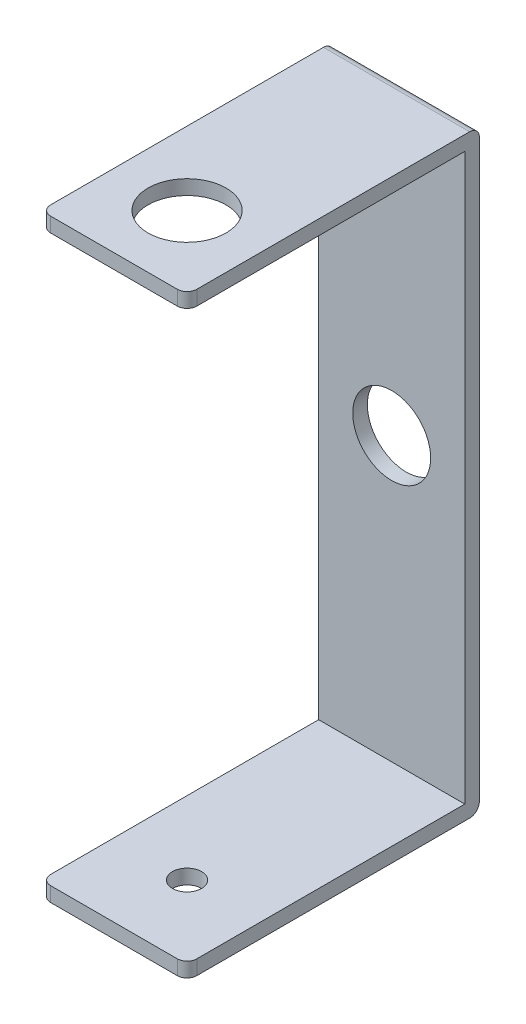
ISO-10303-21;
HEADER;
FILE_DESCRIPTION(('STEP AP214'),'2;1');
FILE_NAME('part.step','',(''),(''),'','','');
FILE_SCHEMA(('AUTOMOTIVE_DESIGN { 1 0 10303 214 1 1 1 1 }'));
ENDSEC;
DATA;
#1=APPLICATION_CONTEXT('core data for automotive mechanical design processes');
#2=APPLICATION_PROTOCOL_DEFINITION('international standard','automotive_design',2000,#1);
#3=PRODUCT_CONTEXT('',#1,'mechanical');
#4=PRODUCT('Part','Part','',(#3));
#5=PRODUCT_RELATED_PRODUCT_CATEGORY('part','',(#4));
#6=PRODUCT_DEFINITION_FORMATION('','',#4);
#7=PRODUCT_DEFINITION_CONTEXT('part definition',#1,'design');
#8=PRODUCT_DEFINITION('design','',#6,#7);
#9=PRODUCT_DEFINITION_SHAPE('','',#8);
#10=(LENGTH_UNIT() NAMED_UNIT(*) SI_UNIT(.MILLI.,.METRE.));
#11=(NAMED_UNIT(*) PLANE_ANGLE_UNIT() SI_UNIT($,.RADIAN.));
#12=(NAMED_UNIT(*) SI_UNIT($,.STERADIAN.) SOLID_ANGLE_UNIT());
#13=UNCERTAINTY_MEASURE_WITH_UNIT(LENGTH_MEASURE(1.E-05),#10,'distance_accuracy_value','');
#14=(GEOMETRIC_REPRESENTATION_CONTEXT(3) GLOBAL_UNCERTAINTY_ASSIGNED_CONTEXT((#13)) GLOBAL_UNIT_ASSIGNED_CONTEXT((#10,
#11,#12)) REPRESENTATION_CONTEXT('',''));
#15=CARTESIAN_POINT('',(0.,0.,0.));
#16=DIRECTION('',(0.,0.,1.));
#17=DIRECTION('',(1.,0.,0.));
#18=AXIS2_PLACEMENT_3D('',#15,#16,#17);
#19=CARTESIAN_POINT('',(0.,0.,1.5));
#20=DIRECTION('',(0.,0.,1.));
#21=DIRECTION('',(1.,0.,0.));
#22=AXIS2_PLACEMENT_3D('',#19,#20,#21);
#23=PLANE('',#22);
#24=CARTESIAN_POINT('',(0.,0.,1.5));
#25=DIRECTION('',(0.,0.,1.));
#26=DIRECTION('',(1.,0.,0.));
#27=AXIS2_PLACEMENT_3D('',#24,#25,#26);
#28=CIRCLE('',#27,4.);
#29=CARTESIAN_POINT('',(4.,0.,1.5));
#30=VERTEX_POINT('',#29);
#31=EDGE_CURVE('E159',#30,#30,#28,.T.);
#32=ORIENTED_EDGE('',*,*,#31,.F.);
#33=EDGE_LOOP('',(#32));
#34=FACE_BOUND('',#33,.T.);
#35=DIRECTION('',(0.,1.,0.));
#36=VECTOR('',#35,1.);
#37=CARTESIAN_POINT('',(-7.5,0.,1.5));
#38=LINE('',#37,#36);
#39=CARTESIAN_POINT('',(-7.49999999999999,-29.,1.5));
#40=VERTEX_POINT('',#39);
#41=CARTESIAN_POINT('',(-7.5,29.,1.5));
#42=VERTEX_POINT('',#41);
#43=EDGE_CURVE('E158',#40,#42,#38,.T.);
#44=ORIENTED_EDGE('',*,*,#43,.F.);
#45=DIRECTION('',(-1.,0.,0.));
#46=VECTOR('',#45,1.);
#47=CARTESIAN_POINT('',(7.5,-29.,1.5));
#48=LINE('',#47,#46);
#49=CARTESIAN_POINT('',(7.5,-29.,1.5));
#50=VERTEX_POINT('',#49);
#51=EDGE_CURVE('E157',#50,#40,#48,.T.);
#52=ORIENTED_EDGE('',*,*,#51,.F.);
#53=DIRECTION('',(0.,1.,0.));
#54=VECTOR('',#53,1.);
#55=CARTESIAN_POINT('',(7.5,0.,1.5));
#56=LINE('',#55,#54);
#57=CARTESIAN_POINT('',(7.5,29.,1.5));
#58=VERTEX_POINT('',#57);
#59=EDGE_CURVE('E142',#50,#58,#56,.T.);
#60=ORIENTED_EDGE('',*,*,#59,.T.);
#61=DIRECTION('',(1.,0.,0.));
#62=VECTOR('',#61,1.);
#63=CARTESIAN_POINT('',(-7.49999999999999,29.,1.5));
#64=LINE('',#63,#62);
#65=EDGE_CURVE('E155',#42,#58,#64,.T.);
#66=ORIENTED_EDGE('',*,*,#65,.F.);
#67=EDGE_LOOP('',(#44,#52,#60,#66));
#68=FACE_BOUND('',#67,.T.);
#69=ADVANCED_FACE('F34',(#34,#68),#23,.T.);
#70=CARTESIAN_POINT('',(0.,-30.5,1.5));
#71=DIRECTION('',(0.,1.,0.));
#72=DIRECTION('',(-1.,0.,0.));
#73=AXIS2_PLACEMENT_3D('',#70,#71,#72);
#74=PLANE('',#73);
#75=CARTESIAN_POINT('',(0.,-30.5,22.5));
#76=DIRECTION('',(0.,1.,0.));
#77=DIRECTION('',(0.,0.,1.));
#78=AXIS2_PLACEMENT_3D('',#75,#76,#77);
#79=CIRCLE('',#78,1.5);
#80=CARTESIAN_POINT('',(0.,-30.5,24.));
#81=VERTEX_POINT('',#80);
#82=EDGE_CURVE('E193',#81,#81,#79,.T.);
#83=ORIENTED_EDGE('',*,*,#82,.T.);
#84=EDGE_LOOP('',(#83));
#85=FACE_BOUND('',#84,.T.);
#86=DIRECTION('',(0.,0.,-1.));
#87=VECTOR('',#86,1.);
#88=CARTESIAN_POINT('',(-7.49999999999999,-30.5,1.5));
#89=LINE('',#88,#87);
#90=CARTESIAN_POINT('',(-7.49999999999999,-30.5,29.));
#91=VERTEX_POINT('',#90);
#92=CARTESIAN_POINT('',(-7.49999999999999,-30.5,1.));
#93=VERTEX_POINT('',#92);
#94=EDGE_CURVE('E329',#91,#93,#89,.T.);
#95=ORIENTED_EDGE('',*,*,#94,.T.);
#96=DIRECTION('',(1.,0.,0.));
#97=VECTOR('',#96,1.);
#98=CARTESIAN_POINT('',(0.,-30.5,1.));
#99=LINE('',#98,#97);
#100=CARTESIAN_POINT('',(7.5,-30.5,1.));
#101=VERTEX_POINT('',#100);
#102=EDGE_CURVE('E198',#93,#101,#99,.T.);
#103=ORIENTED_EDGE('',*,*,#102,.T.);
#104=DIRECTION('',(0.,0.,-1.));
#105=VECTOR('',#104,1.);
#106=CARTESIAN_POINT('',(7.5,-30.5,1.5));
#107=LINE('',#106,#105);
#108=CARTESIAN_POINT('',(7.5,-30.5,29.));
#109=VERTEX_POINT('',#108);
#110=EDGE_CURVE('E174',#109,#101,#107,.T.);
#111=ORIENTED_EDGE('',*,*,#110,.F.);
#112=CARTESIAN_POINT('',(6.5,-30.5,29.));
#113=DIRECTION('',(0.,1.,0.));
#114=DIRECTION('',(-1.,0.,0.));
#115=AXIS2_PLACEMENT_3D('',#112,#113,#114);
#116=CIRCLE('',#115,1.);
#117=CARTESIAN_POINT('',(6.5,-30.5,30.));
#118=VERTEX_POINT('',#117);
#119=EDGE_CURVE('E194',#109,#118,#116,.F.);
#120=ORIENTED_EDGE('',*,*,#119,.T.);
#121=DIRECTION('',(1.,0.,0.));
#122=VECTOR('',#121,1.);
#123=CARTESIAN_POINT('',(7.5,-30.5,30.));
#124=LINE('',#123,#122);
#125=CARTESIAN_POINT('',(-6.49999999999999,-30.5,30.));
#126=VERTEX_POINT('',#125);
#127=EDGE_CURVE('E321',#126,#118,#124,.T.);
#128=ORIENTED_EDGE('',*,*,#127,.F.);
#129=CARTESIAN_POINT('',(-6.49999999999999,-30.5,29.));
#130=DIRECTION('',(0.,1.,0.));
#131=DIRECTION('',(-1.,0.,0.));
#132=AXIS2_PLACEMENT_3D('',#129,#130,#131);
#133=CIRCLE('',#132,1.);
#134=EDGE_CURVE('E196',#126,#91,#133,.F.);
#135=ORIENTED_EDGE('',*,*,#134,.T.);
#136=EDGE_LOOP('',(#95,#103,#111,#120,#128,#135));
#137=FACE_BOUND('',#136,.T.);
#138=ADVANCED_FACE('F271',(#85,#137),#74,.F.);
#139=CARTESIAN_POINT('',(7.5,0.,1.5));
#140=DIRECTION('',(-1.,0.,0.));
#141=DIRECTION('',(0.,0.,1.));
#142=AXIS2_PLACEMENT_3D('',#139,#140,#141);
#143=PLANE('',#142);
#144=ORIENTED_EDGE('',*,*,#110,.T.);
#145=CARTESIAN_POINT('',(7.5,-29.5,1.));
#146=DIRECTION('',(-1.,0.,0.));
#147=DIRECTION('',(0.,0.,1.));
#148=AXIS2_PLACEMENT_3D('',#145,#146,#147);
#149=CIRCLE('',#148,1.);
#150=CARTESIAN_POINT('',(7.5,-29.5,0.));
#151=VERTEX_POINT('',#150);
#152=EDGE_CURVE('E206',#101,#151,#149,.F.);
#153=ORIENTED_EDGE('',*,*,#152,.T.);
#154=DIRECTION('',(0.,1.,0.));
#155=VECTOR('',#154,1.);
#156=CARTESIAN_POINT('',(7.5,0.,0.));
#157=LINE('',#156,#155);
#158=CARTESIAN_POINT('',(7.5,29.5,0.));
#159=VERTEX_POINT('',#158);
#160=EDGE_CURVE('E337',#151,#159,#157,.T.);
#161=ORIENTED_EDGE('',*,*,#160,.T.);
#162=CARTESIAN_POINT('',(7.5,29.5,1.));
#163=DIRECTION('',(-1.,0.,0.));
#164=DIRECTION('',(0.,0.,1.));
#165=AXIS2_PLACEMENT_3D('',#162,#163,#164);
#166=CIRCLE('',#165,1.);
#167=CARTESIAN_POINT('',(7.5,30.5,1.));
#168=VERTEX_POINT('',#167);
#169=EDGE_CURVE('E200',#159,#168,#166,.F.);
#170=ORIENTED_EDGE('',*,*,#169,.T.);
#171=DIRECTION('',(0.,0.,-1.));
#172=VECTOR('',#171,1.);
#173=CARTESIAN_POINT('',(7.5,30.5,1.5));
#174=LINE('',#173,#172);
#175=CARTESIAN_POINT('',(7.5,30.5,29.));
#176=VERTEX_POINT('',#175);
#177=EDGE_CURVE('E255',#176,#168,#174,.T.);
#178=ORIENTED_EDGE('',*,*,#177,.F.);
#179=DIRECTION('',(0.,1.,0.));
#180=VECTOR('',#179,1.);
#181=CARTESIAN_POINT('',(7.5,29.,29.));
#182=LINE('',#181,#180);
#183=CARTESIAN_POINT('',(7.5,29.,29.));
#184=VERTEX_POINT('',#183);
#185=EDGE_CURVE('E144',#176,#184,#182,.F.);
#186=ORIENTED_EDGE('',*,*,#185,.T.);
#187=DIRECTION('',(0.,0.,-1.));
#188=VECTOR('',#187,1.);
#189=CARTESIAN_POINT('',(7.5,29.,30.));
#190=LINE('',#189,#188);
#191=EDGE_CURVE('E137',#184,#58,#190,.T.);
#192=ORIENTED_EDGE('',*,*,#191,.T.);
#193=ORIENTED_EDGE('',*,*,#59,.F.);
#194=DIRECTION('',(0.,0.,-1.));
#195=VECTOR('',#194,1.);
#196=CARTESIAN_POINT('',(7.5,-29.,30.));
#197=LINE('',#196,#195);
#198=CARTESIAN_POINT('',(7.5,-29.,29.));
#199=VERTEX_POINT('',#198);
#200=EDGE_CURVE('E165',#199,#50,#197,.T.);
#201=ORIENTED_EDGE('',*,*,#200,.F.);
#202=DIRECTION('',(0.,1.,0.));
#203=VECTOR('',#202,1.);
#204=CARTESIAN_POINT('',(7.5,-30.5,29.));
#205=LINE('',#204,#203);
#206=EDGE_CURVE('E204',#199,#109,#205,.F.);
#207=ORIENTED_EDGE('',*,*,#206,.T.);
#208=EDGE_LOOP('',(#144,#153,#161,#170,#178,#186,#192,#193,#201,#207));
#209=FACE_BOUND('',#208,.T.);
#210=ADVANCED_FACE('F140',(#209),#143,.F.);
#211=CARTESIAN_POINT('',(0.,30.5,1.5));
#212=DIRECTION('',(0.,1.,0.));
#213=DIRECTION('',(0.,0.,1.));
#214=AXIS2_PLACEMENT_3D('',#211,#212,#213);
#215=PLANE('',#214);
#216=CARTESIAN_POINT('',(0.,30.5,22.5));
#217=DIRECTION('',(0.,1.,0.));
#218=DIRECTION('',(0.,0.,1.));
#219=AXIS2_PLACEMENT_3D('',#216,#217,#218);
#220=CIRCLE('',#219,4.);
#221=CARTESIAN_POINT('',(0.,30.5,26.5));
#222=VERTEX_POINT('',#221);
#223=EDGE_CURVE('E381',#222,#222,#220,.T.);
#224=ORIENTED_EDGE('',*,*,#223,.F.);
#225=EDGE_LOOP('',(#224));
#226=FACE_BOUND('',#225,.T.);
#227=DIRECTION('',(-1.,0.,0.));
#228=VECTOR('',#227,1.);
#229=CARTESIAN_POINT('',(-7.5,30.5,30.));
#230=LINE('',#229,#228);
#231=CARTESIAN_POINT('',(6.49999999999999,30.5,30.));
#232=VERTEX_POINT('',#231);
#233=CARTESIAN_POINT('',(-6.5,30.5,30.));
#234=VERTEX_POINT('',#233);
#235=EDGE_CURVE('E149',#232,#234,#230,.T.);
#236=ORIENTED_EDGE('',*,*,#235,.F.);
#237=CARTESIAN_POINT('',(6.5,30.5,29.));
#238=DIRECTION('',(0.,1.,0.));
#239=DIRECTION('',(0.,0.,1.));
#240=AXIS2_PLACEMENT_3D('',#237,#238,#239);
#241=CIRCLE('',#240,1.);
#242=EDGE_CURVE('E57',#232,#176,#241,.T.);
#243=ORIENTED_EDGE('',*,*,#242,.T.);
#244=ORIENTED_EDGE('',*,*,#177,.T.);
#245=DIRECTION('',(1.,0.,0.));
#246=VECTOR('',#245,1.);
#247=CARTESIAN_POINT('',(-7.5,30.5,1.));
#248=LINE('',#247,#246);
#249=CARTESIAN_POINT('',(-7.5,30.5,1.));
#250=VERTEX_POINT('',#249);
#251=EDGE_CURVE('E239',#168,#250,#248,.F.);
#252=ORIENTED_EDGE('',*,*,#251,.T.);
#253=DIRECTION('',(0.,0.,-1.));
#254=VECTOR('',#253,1.);
#255=CARTESIAN_POINT('',(-7.5,30.5,1.5));
#256=LINE('',#255,#254);
#257=CARTESIAN_POINT('',(-7.5,30.5,29.));
#258=VERTEX_POINT('',#257);
#259=EDGE_CURVE('E258',#258,#250,#256,.T.);
#260=ORIENTED_EDGE('',*,*,#259,.F.);
#261=CARTESIAN_POINT('',(-6.5,30.5,29.));
#262=DIRECTION('',(0.,1.,0.));
#263=DIRECTION('',(0.,0.,1.));
#264=AXIS2_PLACEMENT_3D('',#261,#262,#263);
#265=CIRCLE('',#264,1.);
#266=EDGE_CURVE('E49',#258,#234,#265,.T.);
#267=ORIENTED_EDGE('',*,*,#266,.T.);
#268=EDGE_LOOP('',(#236,#243,#244,#252,#260,#267));
#269=FACE_BOUND('',#268,.T.);
#270=ADVANCED_FACE('F253',(#226,#269),#215,.T.);
#271=CARTESIAN_POINT('',(0.,0.,1.5));
#272=DIRECTION('',(0.,0.,-1.));
#273=DIRECTION('',(-1.,0.,0.));
#274=AXIS2_PLACEMENT_3D('',#271,#272,#273);
#275=CYLINDRICAL_SURFACE('',#274,4.);
#276=ORIENTED_EDGE('',*,*,#31,.T.);
#277=EDGE_LOOP('',(#276));
#278=FACE_BOUND('',#277,.T.);
#279=CARTESIAN_POINT('',(0.,0.,0.));
#280=DIRECTION('',(0.,0.,1.));
#281=DIRECTION('',(1.,0.,0.));
#282=AXIS2_PLACEMENT_3D('',#279,#280,#281);
#283=CIRCLE('',#282,4.);
#284=CARTESIAN_POINT('',(4.,0.,0.));
#285=VERTEX_POINT('',#284);
#286=EDGE_CURVE('E215',#285,#285,#283,.T.);
#287=ORIENTED_EDGE('',*,*,#286,.F.);
#288=EDGE_LOOP('',(#287));
#289=FACE_BOUND('',#288,.T.);
#290=ADVANCED_FACE('F289',(#278,#289),#275,.F.);
#291=CARTESIAN_POINT('',(-7.5,0.,1.5));
#292=DIRECTION('',(-1.,0.,0.));
#293=DIRECTION('',(0.,-1.,0.));
#294=AXIS2_PLACEMENT_3D('',#291,#292,#293);
#295=PLANE('',#294);
#296=DIRECTION('',(0.,1.,0.));
#297=VECTOR('',#296,1.);
#298=CARTESIAN_POINT('',(-7.5,0.,0.));
#299=LINE('',#298,#297);
#300=CARTESIAN_POINT('',(-7.49999999999999,-29.5,0.));
#301=VERTEX_POINT('',#300);
#302=CARTESIAN_POINT('',(-7.5,29.5,0.));
#303=VERTEX_POINT('',#302);
#304=EDGE_CURVE('E183',#301,#303,#299,.T.);
#305=ORIENTED_EDGE('',*,*,#304,.F.);
#306=CARTESIAN_POINT('',(-7.49999999999999,-29.5,1.));
#307=DIRECTION('',(-1.,0.,0.));
#308=DIRECTION('',(0.,-1.,0.));
#309=AXIS2_PLACEMENT_3D('',#306,#307,#308);
#310=CIRCLE('',#309,1.);
#311=EDGE_CURVE('E222',#301,#93,#310,.T.);
#312=ORIENTED_EDGE('',*,*,#311,.T.);
#313=ORIENTED_EDGE('',*,*,#94,.F.);
#314=DIRECTION('',(0.,-1.,0.));
#315=VECTOR('',#314,1.);
#316=CARTESIAN_POINT('',(-7.5,0.,29.));
#317=LINE('',#316,#315);
#318=CARTESIAN_POINT('',(-7.49999999999999,-29.,29.));
#319=VERTEX_POINT('',#318);
#320=EDGE_CURVE('E220',#91,#319,#317,.F.);
#321=ORIENTED_EDGE('',*,*,#320,.T.);
#322=DIRECTION('',(0.,0.,-1.));
#323=VECTOR('',#322,1.);
#324=CARTESIAN_POINT('',(-7.49999999999999,-29.,30.));
#325=LINE('',#324,#323);
#326=EDGE_CURVE('E169',#319,#40,#325,.T.);
#327=ORIENTED_EDGE('',*,*,#326,.T.);
#328=ORIENTED_EDGE('',*,*,#43,.T.);
#329=DIRECTION('',(0.,0.,-1.));
#330=VECTOR('',#329,1.);
#331=CARTESIAN_POINT('',(-7.49999999999999,29.,30.));
#332=LINE('',#331,#330);
#333=CARTESIAN_POINT('',(-7.49999999999999,29.,29.));
#334=VERTEX_POINT('',#333);
#335=EDGE_CURVE('E148',#334,#42,#332,.T.);
#336=ORIENTED_EDGE('',*,*,#335,.F.);
#337=DIRECTION('',(0.,-1.,0.));
#338=VECTOR('',#337,1.);
#339=CARTESIAN_POINT('',(-7.5,0.,29.));
#340=LINE('',#339,#338);
#341=EDGE_CURVE('E218',#334,#258,#340,.F.);
#342=ORIENTED_EDGE('',*,*,#341,.T.);
#343=ORIENTED_EDGE('',*,*,#259,.T.);
#344=CARTESIAN_POINT('',(-7.5,29.5,1.));
#345=DIRECTION('',(-1.,0.,0.));
#346=DIRECTION('',(0.,-1.,0.));
#347=AXIS2_PLACEMENT_3D('',#344,#345,#346);
#348=CIRCLE('',#347,1.);
#349=EDGE_CURVE('E213',#250,#303,#348,.T.);
#350=ORIENTED_EDGE('',*,*,#349,.T.);
#351=EDGE_LOOP('',(#305,#312,#313,#321,#327,#328,#336,#342,#343,#350));
#352=FACE_BOUND('',#351,.T.);
#353=ADVANCED_FACE('F248',(#352),#295,.T.);
#354=CARTESIAN_POINT('',(0.,0.,0.));
#355=DIRECTION('',(0.,0.,1.));
#356=DIRECTION('',(1.,0.,0.));
#357=AXIS2_PLACEMENT_3D('',#354,#355,#356);
#358=PLANE('',#357);
#359=ORIENTED_EDGE('',*,*,#286,.T.);
#360=EDGE_LOOP('',(#359));
#361=FACE_BOUND('',#360,.T.);
#362=ORIENTED_EDGE('',*,*,#160,.F.);
#363=DIRECTION('',(1.,0.,0.));
#364=VECTOR('',#363,1.);
#365=CARTESIAN_POINT('',(0.,-29.5,0.));
#366=LINE('',#365,#364);
#367=EDGE_CURVE('E211',#151,#301,#366,.F.);
#368=ORIENTED_EDGE('',*,*,#367,.T.);
#369=ORIENTED_EDGE('',*,*,#304,.T.);
#370=DIRECTION('',(1.,0.,0.));
#371=VECTOR('',#370,1.);
#372=CARTESIAN_POINT('',(7.5,29.5,0.));
#373=LINE('',#372,#371);
#374=EDGE_CURVE('E208',#303,#159,#373,.T.);
#375=ORIENTED_EDGE('',*,*,#374,.T.);
#376=EDGE_LOOP('',(#362,#368,#369,#375));
#377=FACE_BOUND('',#376,.T.);
#378=ADVANCED_FACE('F283',(#361,#377),#358,.F.);
#379=CARTESIAN_POINT('',(-7.49999999999999,29.,30.));
#380=DIRECTION('',(0.,1.,0.));
#381=DIRECTION('',(-1.,0.,0.));
#382=AXIS2_PLACEMENT_3D('',#379,#380,#381);
#383=PLANE('',#382);
#384=CARTESIAN_POINT('',(0.,29.,22.5));
#385=DIRECTION('',(0.,1.,0.));
#386=DIRECTION('',(-1.,0.,0.));
#387=AXIS2_PLACEMENT_3D('',#384,#385,#386);
#388=CIRCLE('',#387,4.);
#389=CARTESIAN_POINT('',(-4.,29.,22.5));
#390=VERTEX_POINT('',#389);
#391=EDGE_CURVE('E380',#390,#390,#388,.F.);
#392=ORIENTED_EDGE('',*,*,#391,.F.);
#393=EDGE_LOOP('',(#392));
#394=FACE_BOUND('',#393,.T.);
#395=ORIENTED_EDGE('',*,*,#191,.F.);
#396=CARTESIAN_POINT('',(6.5,29.,29.));
#397=DIRECTION('',(0.,1.,0.));
#398=DIRECTION('',(-1.,0.,0.));
#399=AXIS2_PLACEMENT_3D('',#396,#397,#398);
#400=CIRCLE('',#399,1.);
#401=CARTESIAN_POINT('',(6.5,29.,30.));
#402=VERTEX_POINT('',#401);
#403=EDGE_CURVE('E11',#184,#402,#400,.F.);
#404=ORIENTED_EDGE('',*,*,#403,.T.);
#405=DIRECTION('',(1.,0.,0.));
#406=VECTOR('',#405,1.);
#407=CARTESIAN_POINT('',(-7.49999999999999,29.,30.));
#408=LINE('',#407,#406);
#409=CARTESIAN_POINT('',(-6.5,29.,30.));
#410=VERTEX_POINT('',#409);
#411=EDGE_CURVE('E164',#410,#402,#408,.T.);
#412=ORIENTED_EDGE('',*,*,#411,.F.);
#413=CARTESIAN_POINT('',(-6.5,29.,29.));
#414=DIRECTION('',(0.,1.,0.));
#415=DIRECTION('',(-1.,0.,0.));
#416=AXIS2_PLACEMENT_3D('',#413,#414,#415);
#417=CIRCLE('',#416,1.);
#418=EDGE_CURVE('E42',#410,#334,#417,.F.);
#419=ORIENTED_EDGE('',*,*,#418,.T.);
#420=ORIENTED_EDGE('',*,*,#335,.T.);
#421=ORIENTED_EDGE('',*,*,#65,.T.);
#422=EDGE_LOOP('',(#395,#404,#412,#419,#420,#421));
#423=FACE_BOUND('',#422,.T.);
#424=ADVANCED_FACE('F161',(#394,#423),#383,.F.);
#425=CARTESIAN_POINT('',(0.,0.,30.));
#426=DIRECTION('',(0.,0.,1.));
#427=DIRECTION('',(1.,0.,0.));
#428=AXIS2_PLACEMENT_3D('',#425,#426,#427);
#429=PLANE('',#428);
#430=ORIENTED_EDGE('',*,*,#411,.T.);
#431=DIRECTION('',(0.,1.,0.));
#432=VECTOR('',#431,1.);
#433=CARTESIAN_POINT('',(6.5,30.5,30.));
#434=LINE('',#433,#432);
#435=EDGE_CURVE('E237',#402,#232,#434,.T.);
#436=ORIENTED_EDGE('',*,*,#435,.T.);
#437=ORIENTED_EDGE('',*,*,#235,.T.);
#438=DIRECTION('',(0.,-1.,0.));
#439=VECTOR('',#438,1.);
#440=CARTESIAN_POINT('',(-6.5,0.,30.));
#441=LINE('',#440,#439);
#442=EDGE_CURVE('E234',#234,#410,#441,.T.);
#443=ORIENTED_EDGE('',*,*,#442,.T.);
#444=EDGE_LOOP('',(#430,#436,#437,#443));
#445=FACE_BOUND('',#444,.T.);
#446=ADVANCED_FACE('F252',(#445),#429,.T.);
#447=CARTESIAN_POINT('',(7.5,-29.,30.));
#448=DIRECTION('',(0.,-1.,0.));
#449=DIRECTION('',(1.,0.,0.));
#450=AXIS2_PLACEMENT_3D('',#447,#448,#449);
#451=PLANE('',#450);
#452=CARTESIAN_POINT('',(0.,-29.,22.5));
#453=DIRECTION('',(0.,-1.,0.));
#454=DIRECTION('',(1.,0.,0.));
#455=AXIS2_PLACEMENT_3D('',#452,#453,#454);
#456=CIRCLE('',#455,1.5);
#457=CARTESIAN_POINT('',(1.5,-29.,22.5));
#458=VERTEX_POINT('',#457);
#459=EDGE_CURVE('E190',#458,#458,#456,.T.);
#460=ORIENTED_EDGE('',*,*,#459,.T.);
#461=EDGE_LOOP('',(#460));
#462=FACE_BOUND('',#461,.T.);
#463=ORIENTED_EDGE('',*,*,#326,.F.);
#464=CARTESIAN_POINT('',(-6.49999999999999,-29.,29.));
#465=DIRECTION('',(0.,-1.,0.));
#466=DIRECTION('',(1.,0.,0.));
#467=AXIS2_PLACEMENT_3D('',#464,#465,#466);
#468=CIRCLE('',#467,1.);
#469=CARTESIAN_POINT('',(-6.49999999999999,-29.,30.));
#470=VERTEX_POINT('',#469);
#471=EDGE_CURVE('E232',#319,#470,#468,.F.);
#472=ORIENTED_EDGE('',*,*,#471,.T.);
#473=DIRECTION('',(-1.,0.,0.));
#474=VECTOR('',#473,1.);
#475=CARTESIAN_POINT('',(7.5,-29.,30.));
#476=LINE('',#475,#474);
#477=CARTESIAN_POINT('',(6.5,-29.,30.));
#478=VERTEX_POINT('',#477);
#479=EDGE_CURVE('E315',#478,#470,#476,.T.);
#480=ORIENTED_EDGE('',*,*,#479,.F.);
#481=CARTESIAN_POINT('',(6.5,-29.,29.));
#482=DIRECTION('',(0.,-1.,0.));
#483=DIRECTION('',(1.,0.,0.));
#484=AXIS2_PLACEMENT_3D('',#481,#482,#483);
#485=CIRCLE('',#484,1.);
#486=EDGE_CURVE('E230',#478,#199,#485,.F.);
#487=ORIENTED_EDGE('',*,*,#486,.T.);
#488=ORIENTED_EDGE('',*,*,#200,.T.);
#489=ORIENTED_EDGE('',*,*,#51,.T.);
#490=EDGE_LOOP('',(#463,#472,#480,#487,#488,#489));
#491=FACE_BOUND('',#490,.T.);
#492=ADVANCED_FACE('F314',(#462,#491),#451,.F.);
#493=CARTESIAN_POINT('',(0.,0.,30.));
#494=DIRECTION('',(0.,0.,1.));
#495=DIRECTION('',(1.,0.,0.));
#496=AXIS2_PLACEMENT_3D('',#493,#494,#495);
#497=PLANE('',#496);
#498=ORIENTED_EDGE('',*,*,#479,.T.);
#499=DIRECTION('',(0.,-1.,0.));
#500=VECTOR('',#499,1.);
#501=CARTESIAN_POINT('',(-6.5,0.,30.));
#502=LINE('',#501,#500);
#503=EDGE_CURVE('E227',#470,#126,#502,.T.);
#504=ORIENTED_EDGE('',*,*,#503,.T.);
#505=ORIENTED_EDGE('',*,*,#127,.T.);
#506=DIRECTION('',(0.,1.,0.));
#507=VECTOR('',#506,1.);
#508=CARTESIAN_POINT('',(6.5,-29.,30.));
#509=LINE('',#508,#507);
#510=EDGE_CURVE('E224',#118,#478,#509,.T.);
#511=ORIENTED_EDGE('',*,*,#510,.T.);
#512=EDGE_LOOP('',(#498,#504,#505,#511));
#513=FACE_BOUND('',#512,.T.);
#514=ADVANCED_FACE('F317',(#513),#497,.T.);
#515=CARTESIAN_POINT('',(0.,-30.5,22.5));
#516=DIRECTION('',(0.,1.,0.));
#517=DIRECTION('',(0.,0.,1.));
#518=AXIS2_PLACEMENT_3D('',#515,#516,#517);
#519=CYLINDRICAL_SURFACE('',#518,1.5);
#520=ORIENTED_EDGE('',*,*,#82,.F.);
#521=EDGE_LOOP('',(#520));
#522=FACE_BOUND('',#521,.T.);
#523=ORIENTED_EDGE('',*,*,#459,.F.);
#524=EDGE_LOOP('',(#523));
#525=FACE_BOUND('',#524,.T.);
#526=ADVANCED_FACE('F301',(#522,#525),#519,.F.);
#527=CARTESIAN_POINT('',(0.,-29.5,1.));
#528=DIRECTION('',(1.,0.,0.));
#529=DIRECTION('',(0.,1.,0.));
#530=AXIS2_PLACEMENT_3D('',#527,#528,#529);
#531=CYLINDRICAL_SURFACE('',#530,1.);
#532=ORIENTED_EDGE('',*,*,#311,.F.);
#533=ORIENTED_EDGE('',*,*,#367,.F.);
#534=ORIENTED_EDGE('',*,*,#152,.F.);
#535=ORIENTED_EDGE('',*,*,#102,.F.);
#536=EDGE_LOOP('',(#532,#533,#534,#535));
#537=FACE_BOUND('',#536,.T.);
#538=ADVANCED_FACE('F298',(#537),#531,.T.);
#539=CARTESIAN_POINT('',(-6.5,0.,29.));
#540=DIRECTION('',(0.,-1.,0.));
#541=DIRECTION('',(1.,0.,0.));
#542=AXIS2_PLACEMENT_3D('',#539,#540,#541);
#543=CYLINDRICAL_SURFACE('',#542,1.);
#544=ORIENTED_EDGE('',*,*,#471,.F.);
#545=ORIENTED_EDGE('',*,*,#320,.F.);
#546=ORIENTED_EDGE('',*,*,#134,.F.);
#547=ORIENTED_EDGE('',*,*,#503,.F.);
#548=EDGE_LOOP('',(#544,#545,#546,#547));
#549=FACE_BOUND('',#548,.T.);
#550=ADVANCED_FACE('F267',(#549),#543,.T.);
#551=CARTESIAN_POINT('',(6.5,0.,29.));
#552=DIRECTION('',(0.,-1.,0.));
#553=DIRECTION('',(0.,0.,-1.));
#554=AXIS2_PLACEMENT_3D('',#551,#552,#553);
#555=CYLINDRICAL_SURFACE('',#554,1.);
#556=ORIENTED_EDGE('',*,*,#119,.F.);
#557=ORIENTED_EDGE('',*,*,#206,.F.);
#558=ORIENTED_EDGE('',*,*,#486,.F.);
#559=ORIENTED_EDGE('',*,*,#510,.F.);
#560=EDGE_LOOP('',(#556,#557,#558,#559));
#561=FACE_BOUND('',#560,.T.);
#562=ADVANCED_FACE('F261',(#561),#555,.T.);
#563=CARTESIAN_POINT('',(6.5,0.,29.));
#564=DIRECTION('',(0.,-1.,0.));
#565=DIRECTION('',(0.,0.,-1.));
#566=AXIS2_PLACEMENT_3D('',#563,#564,#565);
#567=CYLINDRICAL_SURFACE('',#566,1.);
#568=ORIENTED_EDGE('',*,*,#403,.F.);
#569=ORIENTED_EDGE('',*,*,#185,.F.);
#570=ORIENTED_EDGE('',*,*,#242,.F.);
#571=ORIENTED_EDGE('',*,*,#435,.F.);
#572=EDGE_LOOP('',(#568,#569,#570,#571));
#573=FACE_BOUND('',#572,.T.);
#574=ADVANCED_FACE('F259',(#573),#567,.T.);
#575=CARTESIAN_POINT('',(-6.5,0.,29.));
#576=DIRECTION('',(0.,-1.,0.));
#577=DIRECTION('',(1.,0.,0.));
#578=AXIS2_PLACEMENT_3D('',#575,#576,#577);
#579=CYLINDRICAL_SURFACE('',#578,1.);
#580=ORIENTED_EDGE('',*,*,#266,.F.);
#581=ORIENTED_EDGE('',*,*,#341,.F.);
#582=ORIENTED_EDGE('',*,*,#418,.F.);
#583=ORIENTED_EDGE('',*,*,#442,.F.);
#584=EDGE_LOOP('',(#580,#581,#582,#583));
#585=FACE_BOUND('',#584,.T.);
#586=ADVANCED_FACE('F250',(#585),#579,.T.);
#587=CARTESIAN_POINT('',(0.,29.5,1.));
#588=DIRECTION('',(-1.,0.,0.));
#589=DIRECTION('',(0.,0.,1.));
#590=AXIS2_PLACEMENT_3D('',#587,#588,#589);
#591=CYLINDRICAL_SURFACE('',#590,1.);
#592=ORIENTED_EDGE('',*,*,#349,.F.);
#593=ORIENTED_EDGE('',*,*,#251,.F.);
#594=ORIENTED_EDGE('',*,*,#169,.F.);
#595=ORIENTED_EDGE('',*,*,#374,.F.);
#596=EDGE_LOOP('',(#592,#593,#594,#595));
#597=FACE_BOUND('',#596,.T.);
#598=ADVANCED_FACE('F36',(#597),#591,.T.);
#599=CARTESIAN_POINT('',(0.,-30.501,22.5));
#600=DIRECTION('',(0.,1.,0.));
#601=DIRECTION('',(0.,0.,1.));
#602=AXIS2_PLACEMENT_3D('',#599,#600,#601);
#603=CYLINDRICAL_SURFACE('',#602,4.);
#604=ORIENTED_EDGE('',*,*,#223,.T.);
#605=EDGE_LOOP('',(#604));
#606=FACE_BOUND('',#605,.T.);
#607=ORIENTED_EDGE('',*,*,#391,.T.);
#608=EDGE_LOOP('',(#607));
#609=FACE_BOUND('',#608,.T.);
#610=ADVANCED_FACE('F353',(#606,#609),#603,.F.);
#611=CLOSED_SHELL('',(#69,#138,#210,#270,#290,#353,#378,#424,#446,#492,#514,#526,#538,#550,#562,
#574,#586,#598,#610));
#612=MANIFOLD_SOLID_BREP('B2',#611);
#613=ADVANCED_BREP_SHAPE_REPRESENTATION('',(#18,#612),#14);
#614=SHAPE_DEFINITION_REPRESENTATION(#9,#613);
ENDSEC;
END-ISO-10303-21;
